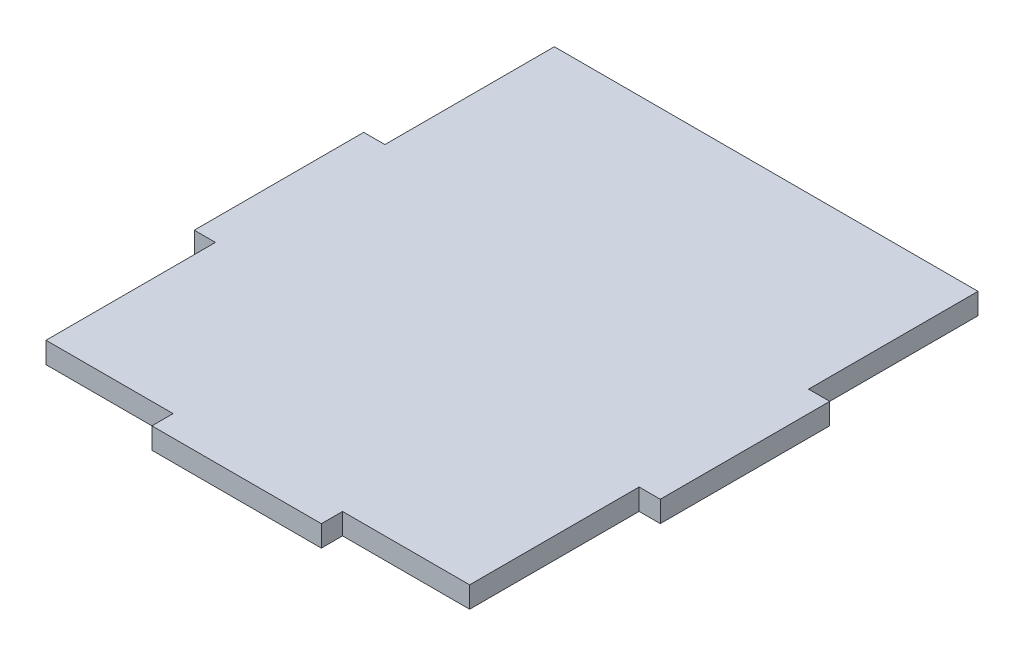
ISO-10303-21;
HEADER;
FILE_DESCRIPTION(('STEP AP214'),'2;1');
FILE_NAME('part.step','',(''),(''),'','','');
FILE_SCHEMA(('AUTOMOTIVE_DESIGN { 1 0 10303 214 1 1 1 1 }'));
ENDSEC;
DATA;
#1=APPLICATION_CONTEXT('core data for automotive mechanical design processes');
#2=APPLICATION_PROTOCOL_DEFINITION('international standard','automotive_design',2000,#1);
#3=PRODUCT_CONTEXT('',#1,'mechanical');
#4=PRODUCT('Part','Part','',(#3));
#5=PRODUCT_RELATED_PRODUCT_CATEGORY('part','',(#4));
#6=PRODUCT_DEFINITION_FORMATION('','',#4);
#7=PRODUCT_DEFINITION_CONTEXT('part definition',#1,'design');
#8=PRODUCT_DEFINITION('design','',#6,#7);
#9=PRODUCT_DEFINITION_SHAPE('','',#8);
#10=(LENGTH_UNIT() NAMED_UNIT(*) SI_UNIT(.MILLI.,.METRE.));
#11=(NAMED_UNIT(*) PLANE_ANGLE_UNIT() SI_UNIT($,.RADIAN.));
#12=(NAMED_UNIT(*) SI_UNIT($,.STERADIAN.) SOLID_ANGLE_UNIT());
#13=UNCERTAINTY_MEASURE_WITH_UNIT(LENGTH_MEASURE(1.E-05),#10,'distance_accuracy_value','');
#14=(GEOMETRIC_REPRESENTATION_CONTEXT(3) GLOBAL_UNCERTAINTY_ASSIGNED_CONTEXT((#13)) GLOBAL_UNIT_ASSIGNED_CONTEXT((#10,
#11,#12)) REPRESENTATION_CONTEXT('',''));
#15=CARTESIAN_POINT('',(0.,0.,0.));
#16=DIRECTION('',(0.,0.,1.));
#17=DIRECTION('',(1.,0.,0.));
#18=AXIS2_PLACEMENT_3D('',#15,#16,#17);
#19=CARTESIAN_POINT('',(-63.5,6.35,0.));
#20=DIRECTION('',(-1.,0.,0.));
#21=DIRECTION('',(0.,0.,1.));
#22=AXIS2_PLACEMENT_3D('',#19,#20,#21);
#23=PLANE('',#22);
#24=DIRECTION('',(0.,0.,-1.));
#25=VECTOR('',#24,1.);
#26=CARTESIAN_POINT('',(-63.5,0.,0.));
#27=LINE('',#26,#25);
#28=CARTESIAN_POINT('',(-63.5,0.,73.025));
#29=VERTEX_POINT('',#28);
#30=CARTESIAN_POINT('',(-63.5,0.,22.225));
#31=VERTEX_POINT('',#30);
#32=EDGE_CURVE('E224',#29,#31,#27,.T.);
#33=ORIENTED_EDGE('',*,*,#32,.F.);
#34=DIRECTION('',(0.,-1.,0.));
#35=VECTOR('',#34,1.);
#36=CARTESIAN_POINT('',(-63.5,12.7,73.025));
#37=LINE('',#36,#35);
#38=CARTESIAN_POINT('',(-63.5,6.35,73.025));
#39=VERTEX_POINT('',#38);
#40=EDGE_CURVE('E57',#39,#29,#37,.T.);
#41=ORIENTED_EDGE('',*,*,#40,.F.);
#42=DIRECTION('',(0.,0.,-1.));
#43=VECTOR('',#42,1.);
#44=CARTESIAN_POINT('',(-63.5,6.35,0.));
#45=LINE('',#44,#43);
#46=CARTESIAN_POINT('',(-63.5,6.35,22.225));
#47=VERTEX_POINT('',#46);
#48=EDGE_CURVE('E180',#39,#47,#45,.T.);
#49=ORIENTED_EDGE('',*,*,#48,.T.);
#50=DIRECTION('',(0.,-1.,0.));
#51=VECTOR('',#50,1.);
#52=CARTESIAN_POINT('',(-63.5,6.35,22.225));
#53=LINE('',#52,#51);
#54=EDGE_CURVE('E243',#47,#31,#53,.T.);
#55=ORIENTED_EDGE('',*,*,#54,.T.);
#56=EDGE_LOOP('',(#33,#41,#49,#55));
#57=FACE_BOUND('',#56,.T.);
#58=ADVANCED_FACE('F41',(#57),#23,.T.);
#59=CARTESIAN_POINT('',(0.,6.35,79.375));
#60=DIRECTION('',(0.,0.,1.));
#61=DIRECTION('',(1.,0.,0.));
#62=AXIS2_PLACEMENT_3D('',#59,#60,#61);
#63=PLANE('',#62);
#64=DIRECTION('',(-1.,0.,0.));
#65=VECTOR('',#64,1.);
#66=CARTESIAN_POINT('',(0.,6.35,79.375));
#67=LINE('',#66,#65);
#68=CARTESIAN_POINT('',(25.4,6.35,79.375));
#69=VERTEX_POINT('',#68);
#70=CARTESIAN_POINT('',(-25.4,6.35,79.375));
#71=VERTEX_POINT('',#70);
#72=EDGE_CURVE('E169',#69,#71,#67,.T.);
#73=ORIENTED_EDGE('',*,*,#72,.T.);
#74=DIRECTION('',(0.,-1.,0.));
#75=VECTOR('',#74,1.);
#76=CARTESIAN_POINT('',(-25.4,12.7,79.375));
#77=LINE('',#76,#75);
#78=CARTESIAN_POINT('',(-25.4,0.,79.375));
#79=VERTEX_POINT('',#78);
#80=EDGE_CURVE('E162',#71,#79,#77,.T.);
#81=ORIENTED_EDGE('',*,*,#80,.T.);
#82=DIRECTION('',(-1.,0.,0.));
#83=VECTOR('',#82,1.);
#84=CARTESIAN_POINT('',(0.,0.,79.375));
#85=LINE('',#84,#83);
#86=CARTESIAN_POINT('',(25.4,0.,79.375));
#87=VERTEX_POINT('',#86);
#88=EDGE_CURVE('E171',#87,#79,#85,.T.);
#89=ORIENTED_EDGE('',*,*,#88,.F.);
#90=DIRECTION('',(0.,-1.,0.));
#91=VECTOR('',#90,1.);
#92=CARTESIAN_POINT('',(25.4,12.7,79.375));
#93=LINE('',#92,#91);
#94=EDGE_CURVE('E65',#69,#87,#93,.T.);
#95=ORIENTED_EDGE('',*,*,#94,.F.);
#96=EDGE_LOOP('',(#73,#81,#89,#95));
#97=FACE_BOUND('',#96,.T.);
#98=ADVANCED_FACE('F167',(#97),#63,.T.);
#99=CARTESIAN_POINT('',(63.5,6.35,0.));
#100=DIRECTION('',(-1.,0.,0.));
#101=DIRECTION('',(0.,0.,1.));
#102=AXIS2_PLACEMENT_3D('',#99,#100,#101);
#103=PLANE('',#102);
#104=DIRECTION('',(0.,-1.,0.));
#105=VECTOR('',#104,1.);
#106=CARTESIAN_POINT('',(63.5,12.7,73.0249999999999));
#107=LINE('',#106,#105);
#108=CARTESIAN_POINT('',(63.5,6.35,73.0249999999999));
#109=VERTEX_POINT('',#108);
#110=CARTESIAN_POINT('',(63.5,0.,73.0249999999999));
#111=VERTEX_POINT('',#110);
#112=EDGE_CURVE('E295',#109,#111,#107,.T.);
#113=ORIENTED_EDGE('',*,*,#112,.T.);
#114=DIRECTION('',(0.,0.,-1.));
#115=VECTOR('',#114,1.);
#116=CARTESIAN_POINT('',(63.5,0.,0.));
#117=LINE('',#116,#115);
#118=CARTESIAN_POINT('',(63.5,0.,22.225));
#119=VERTEX_POINT('',#118);
#120=EDGE_CURVE('E229',#111,#119,#117,.T.);
#121=ORIENTED_EDGE('',*,*,#120,.T.);
#122=DIRECTION('',(0.,-1.,0.));
#123=VECTOR('',#122,1.);
#124=CARTESIAN_POINT('',(63.5,6.35,22.225));
#125=LINE('',#124,#123);
#126=CARTESIAN_POINT('',(63.5,6.35,22.225));
#127=VERTEX_POINT('',#126);
#128=EDGE_CURVE('E239',#127,#119,#125,.T.);
#129=ORIENTED_EDGE('',*,*,#128,.F.);
#130=DIRECTION('',(0.,0.,-1.));
#131=VECTOR('',#130,1.);
#132=CARTESIAN_POINT('',(63.5,6.35,0.));
#133=LINE('',#132,#131);
#134=EDGE_CURVE('E179',#109,#127,#133,.T.);
#135=ORIENTED_EDGE('',*,*,#134,.F.);
#136=EDGE_LOOP('',(#113,#121,#129,#135));
#137=FACE_BOUND('',#136,.T.);
#138=ADVANCED_FACE('F378',(#137),#103,.F.);
#139=CARTESIAN_POINT('',(0.,6.35,0.));
#140=DIRECTION('',(0.,1.,0.));
#141=DIRECTION('',(0.,0.,1.));
#142=AXIS2_PLACEMENT_3D('',#139,#140,#141);
#143=PLANE('',#142);
#144=DIRECTION('',(1.,0.,0.));
#145=VECTOR('',#144,1.);
#146=CARTESIAN_POINT('',(0.,6.35,73.025));
#147=LINE('',#146,#145);
#148=CARTESIAN_POINT('',(-25.4,6.35,73.025));
#149=VERTEX_POINT('',#148);
#150=EDGE_CURVE('E303',#39,#149,#147,.T.);
#151=ORIENTED_EDGE('',*,*,#150,.T.);
#152=DIRECTION('',(0.,0.,1.));
#153=VECTOR('',#152,1.);
#154=CARTESIAN_POINT('',(-25.4,6.35,0.));
#155=LINE('',#154,#153);
#156=EDGE_CURVE('E177',#149,#71,#155,.T.);
#157=ORIENTED_EDGE('',*,*,#156,.T.);
#158=ORIENTED_EDGE('',*,*,#72,.F.);
#159=DIRECTION('',(0.,0.,-1.));
#160=VECTOR('',#159,1.);
#161=CARTESIAN_POINT('',(25.4,6.35,0.));
#162=LINE('',#161,#160);
#163=CARTESIAN_POINT('',(25.4,6.35,73.025));
#164=VERTEX_POINT('',#163);
#165=EDGE_CURVE('E153',#69,#164,#162,.T.);
#166=ORIENTED_EDGE('',*,*,#165,.T.);
#167=DIRECTION('',(1.,0.,0.));
#168=VECTOR('',#167,1.);
#169=CARTESIAN_POINT('',(2.12792746386489E-13,6.35,73.0250000000001));
#170=LINE('',#169,#168);
#171=EDGE_CURVE('E161',#164,#109,#170,.T.);
#172=ORIENTED_EDGE('',*,*,#171,.T.);
#173=ORIENTED_EDGE('',*,*,#134,.T.);
#174=DIRECTION('',(-1.,0.,0.));
#175=VECTOR('',#174,1.);
#176=CARTESIAN_POINT('',(0.,6.35,22.225));
#177=LINE('',#176,#175);
#178=CARTESIAN_POINT('',(69.85,6.35,22.225));
#179=VERTEX_POINT('',#178);
#180=EDGE_CURVE('E184',#179,#127,#177,.T.);
#181=ORIENTED_EDGE('',*,*,#180,.F.);
#182=DIRECTION('',(0.,0.,-1.));
#183=VECTOR('',#182,1.);
#184=CARTESIAN_POINT('',(69.85,6.35,0.));
#185=LINE('',#184,#183);
#186=CARTESIAN_POINT('',(69.85,6.35,-28.575));
#187=VERTEX_POINT('',#186);
#188=EDGE_CURVE('E236',#179,#187,#185,.T.);
#189=ORIENTED_EDGE('',*,*,#188,.T.);
#190=DIRECTION('',(-1.,0.,0.));
#191=VECTOR('',#190,1.);
#192=CARTESIAN_POINT('',(0.,6.35,-28.575));
#193=LINE('',#192,#191);
#194=CARTESIAN_POINT('',(63.5,6.35,-28.575));
#195=VERTEX_POINT('',#194);
#196=EDGE_CURVE('E311',#187,#195,#193,.T.);
#197=ORIENTED_EDGE('',*,*,#196,.T.);
#198=DIRECTION('',(0.,0.,-1.));
#199=VECTOR('',#198,1.);
#200=CARTESIAN_POINT('',(63.5,6.35,0.));
#201=LINE('',#200,#199);
#202=CARTESIAN_POINT('',(63.5,6.35,-79.375));
#203=VERTEX_POINT('',#202);
#204=EDGE_CURVE('E314',#195,#203,#201,.T.);
#205=ORIENTED_EDGE('',*,*,#204,.T.);
#206=DIRECTION('',(-1.,0.,0.));
#207=VECTOR('',#206,1.);
#208=CARTESIAN_POINT('',(0.,6.35,-79.375));
#209=LINE('',#208,#207);
#210=CARTESIAN_POINT('',(-63.5,6.35,-79.375));
#211=VERTEX_POINT('',#210);
#212=EDGE_CURVE('E317',#203,#211,#209,.T.);
#213=ORIENTED_EDGE('',*,*,#212,.T.);
#214=DIRECTION('',(0.,0.,-1.));
#215=VECTOR('',#214,1.);
#216=CARTESIAN_POINT('',(-63.5,6.35,0.));
#217=LINE('',#216,#215);
#218=CARTESIAN_POINT('',(-63.5,6.35,-28.575));
#219=VERTEX_POINT('',#218);
#220=EDGE_CURVE('E320',#219,#211,#217,.T.);
#221=ORIENTED_EDGE('',*,*,#220,.F.);
#222=DIRECTION('',(1.,0.,0.));
#223=VECTOR('',#222,1.);
#224=CARTESIAN_POINT('',(0.,6.35,-28.575));
#225=LINE('',#224,#223);
#226=CARTESIAN_POINT('',(-69.85,6.35,-28.575));
#227=VERTEX_POINT('',#226);
#228=EDGE_CURVE('E324',#227,#219,#225,.T.);
#229=ORIENTED_EDGE('',*,*,#228,.F.);
#230=DIRECTION('',(0.,0.,-1.));
#231=VECTOR('',#230,1.);
#232=CARTESIAN_POINT('',(-69.85,6.35,0.));
#233=LINE('',#232,#231);
#234=CARTESIAN_POINT('',(-69.85,6.35,22.225));
#235=VERTEX_POINT('',#234);
#236=EDGE_CURVE('E328',#235,#227,#233,.T.);
#237=ORIENTED_EDGE('',*,*,#236,.F.);
#238=DIRECTION('',(1.,0.,0.));
#239=VECTOR('',#238,1.);
#240=CARTESIAN_POINT('',(0.,6.35,22.225));
#241=LINE('',#240,#239);
#242=EDGE_CURVE('E186',#235,#47,#241,.T.);
#243=ORIENTED_EDGE('',*,*,#242,.T.);
#244=ORIENTED_EDGE('',*,*,#48,.F.);
#245=EDGE_LOOP('',(#151,#157,#158,#166,#172,#173,#181,#189,#197,#205,#213,#221,#229,#237,#243,#244));
#246=FACE_BOUND('',#245,.T.);
#247=ADVANCED_FACE('F176',(#246),#143,.T.);
#248=CARTESIAN_POINT('',(0.,0.,0.));
#249=DIRECTION('',(0.,1.,0.));
#250=DIRECTION('',(0.,0.,1.));
#251=AXIS2_PLACEMENT_3D('',#248,#249,#250);
#252=PLANE('',#251);
#253=DIRECTION('',(0.,0.,1.));
#254=VECTOR('',#253,1.);
#255=CARTESIAN_POINT('',(-25.4,0.,0.));
#256=LINE('',#255,#254);
#257=CARTESIAN_POINT('',(-25.4,0.,73.025));
#258=VERTEX_POINT('',#257);
#259=EDGE_CURVE('E11',#258,#79,#256,.T.);
#260=ORIENTED_EDGE('',*,*,#259,.F.);
#261=DIRECTION('',(1.,0.,0.));
#262=VECTOR('',#261,1.);
#263=CARTESIAN_POINT('',(0.,0.,73.025));
#264=LINE('',#263,#262);
#265=EDGE_CURVE('E50',#29,#258,#264,.T.);
#266=ORIENTED_EDGE('',*,*,#265,.F.);
#267=ORIENTED_EDGE('',*,*,#32,.T.);
#268=DIRECTION('',(1.,0.,0.));
#269=VECTOR('',#268,1.);
#270=CARTESIAN_POINT('',(0.,0.,22.225));
#271=LINE('',#270,#269);
#272=CARTESIAN_POINT('',(-69.85,0.,22.225));
#273=VERTEX_POINT('',#272);
#274=EDGE_CURVE('E220',#273,#31,#271,.T.);
#275=ORIENTED_EDGE('',*,*,#274,.F.);
#276=DIRECTION('',(0.,0.,-1.));
#277=VECTOR('',#276,1.);
#278=CARTESIAN_POINT('',(-69.85,0.,0.));
#279=LINE('',#278,#277);
#280=CARTESIAN_POINT('',(-69.85,0.,-28.575));
#281=VERTEX_POINT('',#280);
#282=EDGE_CURVE('E216',#273,#281,#279,.T.);
#283=ORIENTED_EDGE('',*,*,#282,.T.);
#284=DIRECTION('',(1.,0.,0.));
#285=VECTOR('',#284,1.);
#286=CARTESIAN_POINT('',(0.,0.,-28.575));
#287=LINE('',#286,#285);
#288=CARTESIAN_POINT('',(-63.5,0.,-28.575));
#289=VERTEX_POINT('',#288);
#290=EDGE_CURVE('E212',#281,#289,#287,.T.);
#291=ORIENTED_EDGE('',*,*,#290,.T.);
#292=DIRECTION('',(0.,0.,-1.));
#293=VECTOR('',#292,1.);
#294=CARTESIAN_POINT('',(-63.5,0.,0.));
#295=LINE('',#294,#293);
#296=CARTESIAN_POINT('',(-63.5,0.,-79.375));
#297=VERTEX_POINT('',#296);
#298=EDGE_CURVE('E208',#289,#297,#295,.T.);
#299=ORIENTED_EDGE('',*,*,#298,.T.);
#300=DIRECTION('',(-1.,0.,0.));
#301=VECTOR('',#300,1.);
#302=CARTESIAN_POINT('',(0.,0.,-79.375));
#303=LINE('',#302,#301);
#304=CARTESIAN_POINT('',(63.5,0.,-79.375));
#305=VERTEX_POINT('',#304);
#306=EDGE_CURVE('E204',#305,#297,#303,.T.);
#307=ORIENTED_EDGE('',*,*,#306,.F.);
#308=DIRECTION('',(0.,0.,-1.));
#309=VECTOR('',#308,1.);
#310=CARTESIAN_POINT('',(63.5,0.,0.));
#311=LINE('',#310,#309);
#312=CARTESIAN_POINT('',(63.5,0.,-28.575));
#313=VERTEX_POINT('',#312);
#314=EDGE_CURVE('E201',#313,#305,#311,.T.);
#315=ORIENTED_EDGE('',*,*,#314,.F.);
#316=DIRECTION('',(-1.,0.,0.));
#317=VECTOR('',#316,1.);
#318=CARTESIAN_POINT('',(0.,0.,-28.575));
#319=LINE('',#318,#317);
#320=CARTESIAN_POINT('',(69.85,0.,-28.575));
#321=VERTEX_POINT('',#320);
#322=EDGE_CURVE('E198',#321,#313,#319,.T.);
#323=ORIENTED_EDGE('',*,*,#322,.F.);
#324=DIRECTION('',(0.,0.,-1.));
#325=VECTOR('',#324,1.);
#326=CARTESIAN_POINT('',(69.85,0.,0.));
#327=LINE('',#326,#325);
#328=CARTESIAN_POINT('',(69.85,0.,22.225));
#329=VERTEX_POINT('',#328);
#330=EDGE_CURVE('E194',#329,#321,#327,.T.);
#331=ORIENTED_EDGE('',*,*,#330,.F.);
#332=DIRECTION('',(-1.,0.,0.));
#333=VECTOR('',#332,1.);
#334=CARTESIAN_POINT('',(0.,0.,22.225));
#335=LINE('',#334,#333);
#336=EDGE_CURVE('E232',#329,#119,#335,.T.);
#337=ORIENTED_EDGE('',*,*,#336,.T.);
#338=ORIENTED_EDGE('',*,*,#120,.F.);
#339=DIRECTION('',(1.,0.,0.));
#340=VECTOR('',#339,1.);
#341=CARTESIAN_POINT('',(2.12792746386489E-13,0.,73.0250000000001));
#342=LINE('',#341,#340);
#343=CARTESIAN_POINT('',(25.4,0.,73.025));
#344=VERTEX_POINT('',#343);
#345=EDGE_CURVE('E274',#344,#111,#342,.T.);
#346=ORIENTED_EDGE('',*,*,#345,.F.);
#347=DIRECTION('',(0.,0.,-1.));
#348=VECTOR('',#347,1.);
#349=CARTESIAN_POINT('',(25.4,0.,0.));
#350=LINE('',#349,#348);
#351=EDGE_CURVE('E271',#87,#344,#350,.T.);
#352=ORIENTED_EDGE('',*,*,#351,.F.);
#353=ORIENTED_EDGE('',*,*,#88,.T.);
#354=EDGE_LOOP('',(#260,#266,#267,#275,#283,#291,#299,#307,#315,#323,#331,#337,#338,#346,#352,#353));
#355=FACE_BOUND('',#354,.T.);
#356=ADVANCED_FACE('F288',(#355),#252,.F.);
#357=CARTESIAN_POINT('',(69.85,6.35,0.));
#358=DIRECTION('',(-1.,0.,0.));
#359=DIRECTION('',(0.,0.,1.));
#360=AXIS2_PLACEMENT_3D('',#357,#358,#359);
#361=PLANE('',#360);
#362=ORIENTED_EDGE('',*,*,#330,.T.);
#363=DIRECTION('',(0.,-1.,0.));
#364=VECTOR('',#363,1.);
#365=CARTESIAN_POINT('',(69.85,6.35,-28.575));
#366=LINE('',#365,#364);
#367=EDGE_CURVE('E267',#187,#321,#366,.T.);
#368=ORIENTED_EDGE('',*,*,#367,.F.);
#369=ORIENTED_EDGE('',*,*,#188,.F.);
#370=DIRECTION('',(0.,-1.,0.));
#371=VECTOR('',#370,1.);
#372=CARTESIAN_POINT('',(69.85,6.35,22.225));
#373=LINE('',#372,#371);
#374=EDGE_CURVE('E193',#179,#329,#373,.T.);
#375=ORIENTED_EDGE('',*,*,#374,.T.);
#376=EDGE_LOOP('',(#362,#368,#369,#375));
#377=FACE_BOUND('',#376,.T.);
#378=ADVANCED_FACE('F43',(#377),#361,.F.);
#379=CARTESIAN_POINT('',(0.,6.35,-28.575));
#380=DIRECTION('',(0.,0.,1.));
#381=DIRECTION('',(1.,0.,0.));
#382=AXIS2_PLACEMENT_3D('',#379,#380,#381);
#383=PLANE('',#382);
#384=ORIENTED_EDGE('',*,*,#322,.T.);
#385=DIRECTION('',(0.,-1.,0.));
#386=VECTOR('',#385,1.);
#387=CARTESIAN_POINT('',(63.5,6.35,-28.575));
#388=LINE('',#387,#386);
#389=EDGE_CURVE('E263',#195,#313,#388,.T.);
#390=ORIENTED_EDGE('',*,*,#389,.F.);
#391=ORIENTED_EDGE('',*,*,#196,.F.);
#392=ORIENTED_EDGE('',*,*,#367,.T.);
#393=EDGE_LOOP('',(#384,#390,#391,#392));
#394=FACE_BOUND('',#393,.T.);
#395=ADVANCED_FACE('F370',(#394),#383,.F.);
#396=CARTESIAN_POINT('',(63.5,6.35,0.));
#397=DIRECTION('',(-1.,0.,0.));
#398=DIRECTION('',(0.,0.,1.));
#399=AXIS2_PLACEMENT_3D('',#396,#397,#398);
#400=PLANE('',#399);
#401=ORIENTED_EDGE('',*,*,#314,.T.);
#402=DIRECTION('',(0.,-1.,0.));
#403=VECTOR('',#402,1.);
#404=CARTESIAN_POINT('',(63.5,6.35,-79.375));
#405=LINE('',#404,#403);
#406=EDGE_CURVE('E259',#203,#305,#405,.T.);
#407=ORIENTED_EDGE('',*,*,#406,.F.);
#408=ORIENTED_EDGE('',*,*,#204,.F.);
#409=ORIENTED_EDGE('',*,*,#389,.T.);
#410=EDGE_LOOP('',(#401,#407,#408,#409));
#411=FACE_BOUND('',#410,.T.);
#412=ADVANCED_FACE('F364',(#411),#400,.F.);
#413=CARTESIAN_POINT('',(0.,6.35,-79.375));
#414=DIRECTION('',(0.,0.,1.));
#415=DIRECTION('',(1.,0.,0.));
#416=AXIS2_PLACEMENT_3D('',#413,#414,#415);
#417=PLANE('',#416);
#418=ORIENTED_EDGE('',*,*,#306,.T.);
#419=DIRECTION('',(0.,-1.,0.));
#420=VECTOR('',#419,1.);
#421=CARTESIAN_POINT('',(-63.5,6.35,-79.375));
#422=LINE('',#421,#420);
#423=EDGE_CURVE('E256',#211,#297,#422,.T.);
#424=ORIENTED_EDGE('',*,*,#423,.F.);
#425=ORIENTED_EDGE('',*,*,#212,.F.);
#426=ORIENTED_EDGE('',*,*,#406,.T.);
#427=EDGE_LOOP('',(#418,#424,#425,#426));
#428=FACE_BOUND('',#427,.T.);
#429=ADVANCED_FACE('F360',(#428),#417,.F.);
#430=CARTESIAN_POINT('',(-63.5,6.35,0.));
#431=DIRECTION('',(-1.,0.,0.));
#432=DIRECTION('',(0.,0.,1.));
#433=AXIS2_PLACEMENT_3D('',#430,#431,#432);
#434=PLANE('',#433);
#435=ORIENTED_EDGE('',*,*,#298,.F.);
#436=DIRECTION('',(0.,-1.,0.));
#437=VECTOR('',#436,1.);
#438=CARTESIAN_POINT('',(-63.5,6.35,-28.575));
#439=LINE('',#438,#437);
#440=EDGE_CURVE('E253',#219,#289,#439,.T.);
#441=ORIENTED_EDGE('',*,*,#440,.F.);
#442=ORIENTED_EDGE('',*,*,#220,.T.);
#443=ORIENTED_EDGE('',*,*,#423,.T.);
#444=EDGE_LOOP('',(#435,#441,#442,#443));
#445=FACE_BOUND('',#444,.T.);
#446=ADVANCED_FACE('F355',(#445),#434,.T.);
#447=CARTESIAN_POINT('',(0.,6.35,-28.575));
#448=DIRECTION('',(0.,0.,-1.));
#449=DIRECTION('',(-1.,0.,0.));
#450=AXIS2_PLACEMENT_3D('',#447,#448,#449);
#451=PLANE('',#450);
#452=ORIENTED_EDGE('',*,*,#290,.F.);
#453=DIRECTION('',(0.,-1.,0.));
#454=VECTOR('',#453,1.);
#455=CARTESIAN_POINT('',(-69.85,6.35,-28.575));
#456=LINE('',#455,#454);
#457=EDGE_CURVE('E250',#227,#281,#456,.T.);
#458=ORIENTED_EDGE('',*,*,#457,.F.);
#459=ORIENTED_EDGE('',*,*,#228,.T.);
#460=ORIENTED_EDGE('',*,*,#440,.T.);
#461=EDGE_LOOP('',(#452,#458,#459,#460));
#462=FACE_BOUND('',#461,.T.);
#463=ADVANCED_FACE('F350',(#462),#451,.T.);
#464=CARTESIAN_POINT('',(-69.85,6.35,0.));
#465=DIRECTION('',(-1.,0.,0.));
#466=DIRECTION('',(0.,0.,1.));
#467=AXIS2_PLACEMENT_3D('',#464,#465,#466);
#468=PLANE('',#467);
#469=ORIENTED_EDGE('',*,*,#282,.F.);
#470=DIRECTION('',(0.,-1.,0.));
#471=VECTOR('',#470,1.);
#472=CARTESIAN_POINT('',(-69.85,6.35,22.225));
#473=LINE('',#472,#471);
#474=EDGE_CURVE('E247',#235,#273,#473,.T.);
#475=ORIENTED_EDGE('',*,*,#474,.F.);
#476=ORIENTED_EDGE('',*,*,#236,.T.);
#477=ORIENTED_EDGE('',*,*,#457,.T.);
#478=EDGE_LOOP('',(#469,#475,#476,#477));
#479=FACE_BOUND('',#478,.T.);
#480=ADVANCED_FACE('F347',(#479),#468,.T.);
#481=CARTESIAN_POINT('',(0.,6.35,22.225));
#482=DIRECTION('',(0.,0.,-1.));
#483=DIRECTION('',(-1.,0.,0.));
#484=AXIS2_PLACEMENT_3D('',#481,#482,#483);
#485=PLANE('',#484);
#486=ORIENTED_EDGE('',*,*,#274,.T.);
#487=ORIENTED_EDGE('',*,*,#54,.F.);
#488=ORIENTED_EDGE('',*,*,#242,.F.);
#489=ORIENTED_EDGE('',*,*,#474,.T.);
#490=EDGE_LOOP('',(#486,#487,#488,#489));
#491=FACE_BOUND('',#490,.T.);
#492=ADVANCED_FACE('F339',(#491),#485,.F.);
#493=CARTESIAN_POINT('',(0.,6.35,22.225));
#494=DIRECTION('',(0.,0.,1.));
#495=DIRECTION('',(1.,0.,0.));
#496=AXIS2_PLACEMENT_3D('',#493,#494,#495);
#497=PLANE('',#496);
#498=ORIENTED_EDGE('',*,*,#336,.F.);
#499=ORIENTED_EDGE('',*,*,#374,.F.);
#500=ORIENTED_EDGE('',*,*,#180,.T.);
#501=ORIENTED_EDGE('',*,*,#128,.T.);
#502=EDGE_LOOP('',(#498,#499,#500,#501));
#503=FACE_BOUND('',#502,.T.);
#504=ADVANCED_FACE('F375',(#503),#497,.T.);
#505=CARTESIAN_POINT('',(63.5,12.7,73.0249999999999));
#506=DIRECTION('',(0.,0.,1.));
#507=DIRECTION('',(1.,0.,0.));
#508=AXIS2_PLACEMENT_3D('',#505,#506,#507);
#509=PLANE('',#508);
#510=DIRECTION('',(0.,-1.,0.));
#511=VECTOR('',#510,1.);
#512=CARTESIAN_POINT('',(25.4,12.7,73.025));
#513=LINE('',#512,#511);
#514=EDGE_CURVE('E156',#164,#344,#513,.T.);
#515=ORIENTED_EDGE('',*,*,#514,.T.);
#516=ORIENTED_EDGE('',*,*,#345,.T.);
#517=ORIENTED_EDGE('',*,*,#112,.F.);
#518=ORIENTED_EDGE('',*,*,#171,.F.);
#519=EDGE_LOOP('',(#515,#516,#517,#518));
#520=FACE_BOUND('',#519,.T.);
#521=ADVANCED_FACE('F292',(#520),#509,.T.);
#522=CARTESIAN_POINT('',(25.4,12.7,79.375));
#523=DIRECTION('',(1.,0.,0.));
#524=DIRECTION('',(0.,0.,-1.));
#525=AXIS2_PLACEMENT_3D('',#522,#523,#524);
#526=PLANE('',#525);
#527=ORIENTED_EDGE('',*,*,#94,.T.);
#528=ORIENTED_EDGE('',*,*,#351,.T.);
#529=ORIENTED_EDGE('',*,*,#514,.F.);
#530=ORIENTED_EDGE('',*,*,#165,.F.);
#531=EDGE_LOOP('',(#527,#528,#529,#530));
#532=FACE_BOUND('',#531,.T.);
#533=ADVANCED_FACE('F154',(#532),#526,.T.);
#534=CARTESIAN_POINT('',(-25.4,12.7,79.375));
#535=DIRECTION('',(-1.,0.,0.));
#536=DIRECTION('',(0.,0.,1.));
#537=AXIS2_PLACEMENT_3D('',#534,#535,#536);
#538=PLANE('',#537);
#539=DIRECTION('',(0.,-1.,0.));
#540=VECTOR('',#539,1.);
#541=CARTESIAN_POINT('',(-25.4,12.7,73.025));
#542=LINE('',#541,#540);
#543=EDGE_CURVE('E280',#149,#258,#542,.T.);
#544=ORIENTED_EDGE('',*,*,#543,.T.);
#545=ORIENTED_EDGE('',*,*,#259,.T.);
#546=ORIENTED_EDGE('',*,*,#80,.F.);
#547=ORIENTED_EDGE('',*,*,#156,.F.);
#548=EDGE_LOOP('',(#544,#545,#546,#547));
#549=FACE_BOUND('',#548,.T.);
#550=ADVANCED_FACE('F285',(#549),#538,.T.);
#551=CARTESIAN_POINT('',(-63.5,12.7,73.025));
#552=DIRECTION('',(0.,0.,1.));
#553=DIRECTION('',(1.,0.,0.));
#554=AXIS2_PLACEMENT_3D('',#551,#552,#553);
#555=PLANE('',#554);
#556=ORIENTED_EDGE('',*,*,#40,.T.);
#557=ORIENTED_EDGE('',*,*,#265,.T.);
#558=ORIENTED_EDGE('',*,*,#543,.F.);
#559=ORIENTED_EDGE('',*,*,#150,.F.);
#560=EDGE_LOOP('',(#556,#557,#558,#559));
#561=FACE_BOUND('',#560,.T.);
#562=ADVANCED_FACE('F279',(#561),#555,.T.);
#563=CLOSED_SHELL('',(#58,#98,#138,#247,#356,#378,#395,#412,#429,#446,#463,#480,#492,#504,#521,
#533,#550,#562));
#564=MANIFOLD_SOLID_BREP('B2',#563);
#565=ADVANCED_BREP_SHAPE_REPRESENTATION('',(#18,#564),#14);
#566=SHAPE_DEFINITION_REPRESENTATION(#9,#565);
ENDSEC;
END-ISO-10303-21;
